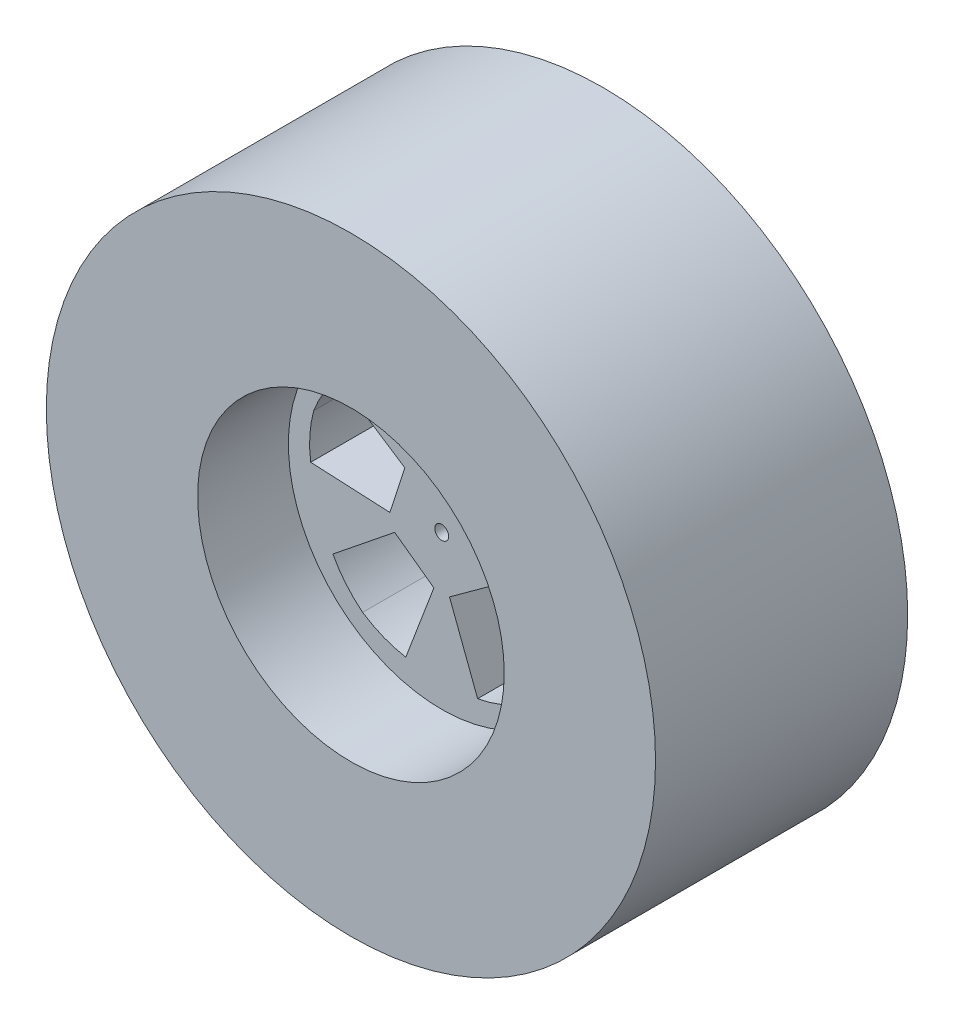
ISO-10303-21;
HEADER;
FILE_DESCRIPTION(('STEP AP214'),'2;1');
FILE_NAME('part.step','',(''),(''),'','','');
FILE_SCHEMA(('AUTOMOTIVE_DESIGN { 1 0 10303 214 1 1 1 1 }'));
ENDSEC;
DATA;
#1=APPLICATION_CONTEXT('core data for automotive mechanical design processes');
#2=APPLICATION_PROTOCOL_DEFINITION('international standard','automotive_design',2000,#1);
#3=PRODUCT_CONTEXT('',#1,'mechanical');
#4=PRODUCT('Part','Part','',(#3));
#5=PRODUCT_RELATED_PRODUCT_CATEGORY('part','',(#4));
#6=PRODUCT_DEFINITION_FORMATION('','',#4);
#7=PRODUCT_DEFINITION_CONTEXT('part definition',#1,'design');
#8=PRODUCT_DEFINITION('design','',#6,#7);
#9=PRODUCT_DEFINITION_SHAPE('','',#8);
#10=(LENGTH_UNIT() NAMED_UNIT(*) SI_UNIT(.MILLI.,.METRE.));
#11=(NAMED_UNIT(*) PLANE_ANGLE_UNIT() SI_UNIT($,.RADIAN.));
#12=(NAMED_UNIT(*) SI_UNIT($,.STERADIAN.) SOLID_ANGLE_UNIT());
#13=UNCERTAINTY_MEASURE_WITH_UNIT(LENGTH_MEASURE(1.E-05),#10,'distance_accuracy_value','');
#14=(GEOMETRIC_REPRESENTATION_CONTEXT(3) GLOBAL_UNCERTAINTY_ASSIGNED_CONTEXT((#13)) GLOBAL_UNIT_ASSIGNED_CONTEXT((#10,
#11,#12)) REPRESENTATION_CONTEXT('',''));
#15=CARTESIAN_POINT('',(0.,0.,0.));
#16=DIRECTION('',(0.,0.,1.));
#17=DIRECTION('',(1.,0.,0.));
#18=AXIS2_PLACEMENT_3D('',#15,#16,#17);
#19=CARTESIAN_POINT('',(0.,0.,-250.));
#20=DIRECTION('',(0.,0.,1.));
#21=DIRECTION('',(1.,0.,0.));
#22=AXIS2_PLACEMENT_3D('',#19,#20,#21);
#23=CYLINDRICAL_SURFACE('',#22,303.999999999998);
#24=CARTESIAN_POINT('',(0.,0.,-250.));
#25=DIRECTION('',(0.,0.,1.));
#26=DIRECTION('',(1.,0.,0.));
#27=AXIS2_PLACEMENT_3D('',#24,#25,#26);
#28=CIRCLE('',#27,303.999999999998);
#29=CARTESIAN_POINT('',(303.999999999998,0.,-250.));
#30=VERTEX_POINT('',#29);
#31=EDGE_CURVE('E425',#30,#30,#28,.T.);
#32=ORIENTED_EDGE('',*,*,#31,.F.);
#33=EDGE_LOOP('',(#32));
#34=FACE_BOUND('',#33,.T.);
#35=CARTESIAN_POINT('',(0.,0.,-70.));
#36=DIRECTION('',(0.,0.,1.));
#37=DIRECTION('',(1.,0.,0.));
#38=AXIS2_PLACEMENT_3D('',#35,#36,#37);
#39=CIRCLE('',#38,303.999999999998);
#40=CARTESIAN_POINT('',(303.999999999998,0.,-70.));
#41=VERTEX_POINT('',#40);
#42=EDGE_CURVE('E11',#41,#41,#39,.F.);
#43=ORIENTED_EDGE('',*,*,#42,.F.);
#44=EDGE_LOOP('',(#43));
#45=FACE_BOUND('',#44,.T.);
#46=ADVANCED_FACE('F41',(#34,#45),#23,.F.);
#47=CARTESIAN_POINT('',(0.,0.,70.));
#48=DIRECTION('',(0.,0.,1.));
#49=DIRECTION('',(1.,0.,0.));
#50=AXIS2_PLACEMENT_3D('',#47,#48,#49);
#51=CIRCLE('',#50,303.999999999998);
#52=CARTESIAN_POINT('',(303.999999999998,0.,70.));
#53=VERTEX_POINT('',#52);
#54=EDGE_CURVE('E377',#53,#53,#51,.T.);
#55=ORIENTED_EDGE('',*,*,#54,.F.);
#56=EDGE_LOOP('',(#55));
#57=FACE_BOUND('',#56,.T.);
#58=CARTESIAN_POINT('',(0.,0.,250.));
#59=DIRECTION('',(0.,0.,1.));
#60=DIRECTION('',(1.,0.,0.));
#61=AXIS2_PLACEMENT_3D('',#58,#59,#60);
#62=CIRCLE('',#61,303.999999999998);
#63=CARTESIAN_POINT('',(303.999999999998,0.,250.));
#64=VERTEX_POINT('',#63);
#65=EDGE_CURVE('E464',#64,#64,#62,.T.);
#66=ORIENTED_EDGE('',*,*,#65,.T.);
#67=EDGE_LOOP('',(#66));
#68=FACE_BOUND('',#67,.T.);
#69=ADVANCED_FACE('F43',(#57,#68),#23,.F.);
#70=CARTESIAN_POINT('',(0.,0.,-250.));
#71=DIRECTION('',(0.,0.,1.));
#72=DIRECTION('',(1.,0.,0.));
#73=AXIS2_PLACEMENT_3D('',#70,#71,#72);
#74=CYLINDRICAL_SURFACE('',#73,604.);
#75=CARTESIAN_POINT('',(0.,0.,-250.));
#76=DIRECTION('',(0.,0.,1.));
#77=DIRECTION('',(1.,0.,0.));
#78=AXIS2_PLACEMENT_3D('',#75,#76,#77);
#79=CIRCLE('',#78,604.);
#80=CARTESIAN_POINT('',(604.,0.,-250.));
#81=VERTEX_POINT('',#80);
#82=EDGE_CURVE('E51',#81,#81,#79,.T.);
#83=ORIENTED_EDGE('',*,*,#82,.T.);
#84=EDGE_LOOP('',(#83));
#85=FACE_BOUND('',#84,.T.);
#86=CARTESIAN_POINT('',(0.,0.,250.));
#87=DIRECTION('',(0.,0.,1.));
#88=DIRECTION('',(1.,0.,0.));
#89=AXIS2_PLACEMENT_3D('',#86,#87,#88);
#90=CIRCLE('',#89,604.);
#91=CARTESIAN_POINT('',(604.,0.,250.));
#92=VERTEX_POINT('',#91);
#93=EDGE_CURVE('E535',#92,#92,#90,.T.);
#94=ORIENTED_EDGE('',*,*,#93,.F.);
#95=EDGE_LOOP('',(#94));
#96=FACE_BOUND('',#95,.T.);
#97=ADVANCED_FACE('F408',(#85,#96),#74,.T.);
#98=CARTESIAN_POINT('',(0.,0.,-250.));
#99=DIRECTION('',(0.,0.,1.));
#100=DIRECTION('',(1.,0.,0.));
#101=AXIS2_PLACEMENT_3D('',#98,#99,#100);
#102=PLANE('',#101);
#103=ORIENTED_EDGE('',*,*,#31,.T.);
#104=EDGE_LOOP('',(#103));
#105=FACE_BOUND('',#104,.T.);
#106=ORIENTED_EDGE('',*,*,#82,.F.);
#107=EDGE_LOOP('',(#106));
#108=FACE_BOUND('',#107,.T.);
#109=ADVANCED_FACE('F405',(#105,#108),#102,.F.);
#110=CARTESIAN_POINT('',(0.,0.,250.));
#111=DIRECTION('',(0.,0.,1.));
#112=DIRECTION('',(1.,0.,0.));
#113=AXIS2_PLACEMENT_3D('',#110,#111,#112);
#114=PLANE('',#113);
#115=ORIENTED_EDGE('',*,*,#65,.F.);
#116=EDGE_LOOP('',(#115));
#117=FACE_BOUND('',#116,.T.);
#118=ORIENTED_EDGE('',*,*,#93,.T.);
#119=EDGE_LOOP('',(#118));
#120=FACE_BOUND('',#119,.T.);
#121=ADVANCED_FACE('F401',(#117,#120),#114,.T.);
#122=CARTESIAN_POINT('',(89.2857032912012,244.115512743488,-70.));
#123=CARTESIAN_POINT('',(47.2088763102181,264.62016009718,-70.));
#124=CARTESIAN_POINT('',(0.,266.705841083731,-70.));
#125=B_SPLINE_CURVE_WITH_KNOTS('',2,(#122,#123,#124),.UNSPECIFIED.,.F.,.F.,(3,3),(0.,1.),.UNSPECIFIED.);
#126=DIRECTION('',(0.,0.,1.));
#127=VECTOR('',#126,1.);
#128=SURFACE_OF_LINEAR_EXTRUSION('',#125,#127);
#129=DIRECTION('',(0.,0.,1.));
#130=VECTOR('',#129,1.);
#131=CARTESIAN_POINT('',(89.2857032912012,244.115512743488,-70.));
#132=LINE('',#131,#130);
#133=CARTESIAN_POINT('',(89.2857032912012,244.115512743488,-70.));
#134=VERTEX_POINT('',#133);
#135=CARTESIAN_POINT('',(89.2857032912012,244.115512743488,70.));
#136=VERTEX_POINT('',#135);
#137=EDGE_CURVE('E473',#134,#136,#132,.T.);
#138=ORIENTED_EDGE('',*,*,#137,.T.);
#139=CARTESIAN_POINT('',(89.2857032912012,244.115512743488,70.));
#140=CARTESIAN_POINT('',(47.2088763102181,264.62016009718,70.));
#141=CARTESIAN_POINT('',(0.,266.705841083731,70.));
#142=B_SPLINE_CURVE_WITH_KNOTS('',2,(#139,#140,#141),.UNSPECIFIED.,.F.,.F.,(3,3),(0.,1.),.UNSPECIFIED.);
#143=CARTESIAN_POINT('',(0.,266.705841083731,70.));
#144=VERTEX_POINT('',#143);
#145=EDGE_CURVE('E347',#136,#144,#142,.T.);
#146=ORIENTED_EDGE('',*,*,#145,.T.);
#147=DIRECTION('',(0.,0.,1.));
#148=VECTOR('',#147,1.);
#149=CARTESIAN_POINT('',(0.,266.705841083731,-70.));
#150=LINE('',#149,#148);
#151=CARTESIAN_POINT('',(0.,266.705841083731,-70.));
#152=VERTEX_POINT('',#151);
#153=EDGE_CURVE('E458',#152,#144,#150,.T.);
#154=ORIENTED_EDGE('',*,*,#153,.F.);
#155=EDGE_CURVE('E58',#134,#152,#125,.T.);
#156=ORIENTED_EDGE('',*,*,#155,.F.);
#157=EDGE_LOOP('',(#138,#146,#154,#156));
#158=FACE_BOUND('',#157,.T.);
#159=ADVANCED_FACE('F404',(#158),#128,.F.);
#160=CARTESIAN_POINT('',(-89.2857032912011,244.115512743488,-70.));
#161=CARTESIAN_POINT('',(-47.208876310218,264.62016009718,-70.));
#162=CARTESIAN_POINT('',(0.,266.705841083731,-70.));
#163=B_SPLINE_CURVE_WITH_KNOTS('',2,(#160,#161,#162),.UNSPECIFIED.,.F.,.F.,(3,3),(0.,1.),.UNSPECIFIED.);
#164=DIRECTION('',(0.,0.,1.));
#165=VECTOR('',#164,1.);
#166=SURFACE_OF_LINEAR_EXTRUSION('',#163,#165);
#167=ORIENTED_EDGE('',*,*,#153,.T.);
#168=CARTESIAN_POINT('',(-89.2857032912011,244.115512743488,70.));
#169=CARTESIAN_POINT('',(-47.208876310218,264.62016009718,70.));
#170=CARTESIAN_POINT('',(0.,266.705841083731,70.));
#171=B_SPLINE_CURVE_WITH_KNOTS('',2,(#168,#169,#170),.UNSPECIFIED.,.F.,.F.,(3,3),(0.,1.),.UNSPECIFIED.);
#172=CARTESIAN_POINT('',(-89.2857032912011,244.115512743488,70.));
#173=VERTEX_POINT('',#172);
#174=EDGE_CURVE('E371',#173,#144,#171,.T.);
#175=ORIENTED_EDGE('',*,*,#174,.F.);
#176=DIRECTION('',(0.,0.,1.));
#177=VECTOR('',#176,1.);
#178=CARTESIAN_POINT('',(-89.2857032912011,244.115512743488,-70.));
#179=LINE('',#178,#177);
#180=CARTESIAN_POINT('',(-89.2857032912011,244.115512743488,-70.));
#181=VERTEX_POINT('',#180);
#182=EDGE_CURVE('E66',#181,#173,#179,.T.);
#183=ORIENTED_EDGE('',*,*,#182,.F.);
#184=EDGE_CURVE('E224',#181,#152,#163,.T.);
#185=ORIENTED_EDGE('',*,*,#184,.T.);
#186=EDGE_LOOP('',(#167,#175,#183,#185));
#187=FACE_BOUND('',#186,.T.);
#188=ADVANCED_FACE('F444',(#187),#166,.T.);
#189=CARTESIAN_POINT('',(-21.337118769043,-5.80123982579253,-70.));
#190=DIRECTION('',(0.964969873653186,0.262360711505658,0.));
#191=DIRECTION('',(-0.262360711505658,0.964969873653186,0.));
#192=AXIS2_PLACEMENT_3D('',#189,#190,#191);
#193=PLANE('',#192);
#194=ORIENTED_EDGE('',*,*,#182,.T.);
#195=DIRECTION('',(-0.262360711505658,0.964969873653186,0.));
#196=VECTOR('',#195,1.);
#197=CARTESIAN_POINT('',(-21.337118769043,-5.80123982579253,70.));
#198=LINE('',#197,#196);
#199=CARTESIAN_POINT('',(-48.0589290693998,92.4823094195891,70.));
#200=VERTEX_POINT('',#199);
#201=EDGE_CURVE('E367',#200,#173,#198,.T.);
#202=ORIENTED_EDGE('',*,*,#201,.F.);
#203=DIRECTION('',(0.,0.,1.));
#204=VECTOR('',#203,1.);
#205=CARTESIAN_POINT('',(-48.0589290693998,92.4823094195891,-70.));
#206=LINE('',#205,#204);
#207=CARTESIAN_POINT('',(-48.0589290693998,92.4823094195891,-70.));
#208=VERTEX_POINT('',#207);
#209=EDGE_CURVE('E467',#208,#200,#206,.T.);
#210=ORIENTED_EDGE('',*,*,#209,.F.);
#211=DIRECTION('',(-0.262360711505658,0.964969873653186,0.));
#212=VECTOR('',#211,1.);
#213=CARTESIAN_POINT('',(-21.337118769043,-5.80123982579253,-70.));
#214=LINE('',#213,#212);
#215=EDGE_CURVE('E456',#208,#181,#214,.T.);
#216=ORIENTED_EDGE('',*,*,#215,.T.);
#217=EDGE_LOOP('',(#194,#202,#210,#216));
#218=FACE_BOUND('',#217,.T.);
#219=ADVANCED_FACE('F448',(#218),#193,.T.);
#220=CARTESIAN_POINT('',(0.,92.4823094195891,-70.));
#221=DIRECTION('',(0.,1.,0.));
#222=DIRECTION('',(-1.,0.,0.));
#223=AXIS2_PLACEMENT_3D('',#220,#221,#222);
#224=PLANE('',#223);
#225=ORIENTED_EDGE('',*,*,#209,.T.);
#226=DIRECTION('',(-1.,0.,0.));
#227=VECTOR('',#226,1.);
#228=CARTESIAN_POINT('',(0.,92.4823094195891,70.));
#229=LINE('',#228,#227);
#230=CARTESIAN_POINT('',(48.0589290693999,92.4823094195891,70.));
#231=VERTEX_POINT('',#230);
#232=EDGE_CURVE('E363',#231,#200,#229,.T.);
#233=ORIENTED_EDGE('',*,*,#232,.F.);
#234=DIRECTION('',(0.,0.,1.));
#235=VECTOR('',#234,1.);
#236=CARTESIAN_POINT('',(48.0589290693999,92.4823094195891,-70.));
#237=LINE('',#236,#235);
#238=CARTESIAN_POINT('',(48.0589290693999,92.4823094195891,-70.));
#239=VERTEX_POINT('',#238);
#240=EDGE_CURVE('E470',#239,#231,#237,.T.);
#241=ORIENTED_EDGE('',*,*,#240,.F.);
#242=DIRECTION('',(-1.,0.,0.));
#243=VECTOR('',#242,1.);
#244=CARTESIAN_POINT('',(0.,92.4823094195891,-70.));
#245=LINE('',#244,#243);
#246=EDGE_CURVE('E546',#239,#208,#245,.T.);
#247=ORIENTED_EDGE('',*,*,#246,.T.);
#248=EDGE_LOOP('',(#225,#233,#241,#247));
#249=FACE_BOUND('',#248,.T.);
#250=ADVANCED_FACE('F739',(#249),#224,.T.);
#251=CARTESIAN_POINT('',(259.75844879513,-9.4799078987993,-70.));
#252=CARTESIAN_POINT('',(266.25707266869,36.8738170824439,-70.));
#253=CARTESIAN_POINT('',(253.652328096662,82.4166373939361,-70.));
#254=B_SPLINE_CURVE_WITH_KNOTS('',2,(#251,#252,#253),.UNSPECIFIED.,.F.,.F.,(3,3),(0.,1.),.UNSPECIFIED.);
#255=DIRECTION('',(0.,0.,1.));
#256=VECTOR('',#255,1.);
#257=SURFACE_OF_LINEAR_EXTRUSION('',#254,#256);
#258=DIRECTION('',(0.,0.,1.));
#259=VECTOR('',#258,1.);
#260=CARTESIAN_POINT('',(259.758448795127,-9.4799078988016,-70.));
#261=LINE('',#260,#259);
#262=CARTESIAN_POINT('',(259.758448795127,-9.4799078988016,-70.));
#263=VERTEX_POINT('',#262);
#264=CARTESIAN_POINT('',(259.758448795127,-9.4799078988016,70.));
#265=VERTEX_POINT('',#264);
#266=EDGE_CURVE('E488',#263,#265,#261,.T.);
#267=ORIENTED_EDGE('',*,*,#266,.T.);
#268=CARTESIAN_POINT('',(259.75844879513,-9.4799078987993,70.));
#269=CARTESIAN_POINT('',(266.25707266869,36.8738170824439,70.));
#270=CARTESIAN_POINT('',(253.652328096662,82.4166373939361,70.));
#271=B_SPLINE_CURVE_WITH_KNOTS('',2,(#268,#269,#270),.UNSPECIFIED.,.F.,.F.,(3,3),(0.,1.),.UNSPECIFIED.);
#272=CARTESIAN_POINT('',(253.652328096662,82.4166373939361,70.));
#273=VERTEX_POINT('',#272);
#274=EDGE_CURVE('E317',#265,#273,#271,.T.);
#275=ORIENTED_EDGE('',*,*,#274,.T.);
#276=DIRECTION('',(0.,0.,1.));
#277=VECTOR('',#276,1.);
#278=CARTESIAN_POINT('',(253.652328096662,82.4166373939361,-70.));
#279=LINE('',#278,#277);
#280=CARTESIAN_POINT('',(253.652328096662,82.4166373939361,-70.));
#281=VERTEX_POINT('',#280);
#282=EDGE_CURVE('E476',#281,#273,#279,.T.);
#283=ORIENTED_EDGE('',*,*,#282,.F.);
#284=EDGE_CURVE('E568',#263,#281,#254,.T.);
#285=ORIENTED_EDGE('',*,*,#284,.F.);
#286=EDGE_LOOP('',(#267,#275,#283,#285));
#287=FACE_BOUND('',#286,.T.);
#288=ADVANCED_FACE('F708',(#287),#257,.F.);
#289=CARTESIAN_POINT('',(204.576849451729,160.351591955386,-70.));
#290=CARTESIAN_POINT('',(237.080382538286,126.67043596605,-70.));
#291=CARTESIAN_POINT('',(253.652328096662,82.4166373939361,-70.));
#292=B_SPLINE_CURVE_WITH_KNOTS('',2,(#289,#290,#291),.UNSPECIFIED.,.F.,.F.,(3,3),(0.,1.),.UNSPECIFIED.);
#293=DIRECTION('',(0.,0.,1.));
#294=VECTOR('',#293,1.);
#295=SURFACE_OF_LINEAR_EXTRUSION('',#292,#294);
#296=ORIENTED_EDGE('',*,*,#282,.T.);
#297=CARTESIAN_POINT('',(204.576849451729,160.351591955386,70.));
#298=CARTESIAN_POINT('',(237.080382538286,126.67043596605,70.));
#299=CARTESIAN_POINT('',(253.652328096662,82.4166373939361,70.));
#300=B_SPLINE_CURVE_WITH_KNOTS('',2,(#297,#298,#299),.UNSPECIFIED.,.F.,.F.,(3,3),(0.,1.),.UNSPECIFIED.);
#301=CARTESIAN_POINT('',(204.576849451727,160.351591955384,70.));
#302=VERTEX_POINT('',#301);
#303=EDGE_CURVE('E341',#302,#273,#300,.T.);
#304=ORIENTED_EDGE('',*,*,#303,.F.);
#305=DIRECTION('',(0.,0.,1.));
#306=VECTOR('',#305,1.);
#307=CARTESIAN_POINT('',(204.576849451727,160.351591955384,-70.));
#308=LINE('',#307,#306);
#309=CARTESIAN_POINT('',(204.576849451727,160.351591955384,-70.));
#310=VERTEX_POINT('',#309);
#311=EDGE_CURVE('E479',#310,#302,#308,.T.);
#312=ORIENTED_EDGE('',*,*,#311,.F.);
#313=EDGE_CURVE('E553',#310,#281,#292,.T.);
#314=ORIENTED_EDGE('',*,*,#313,.T.);
#315=EDGE_LOOP('',(#296,#304,#312,#314));
#316=FACE_BOUND('',#315,.T.);
#317=ADVANCED_FACE('F712',(#316),#295,.T.);
#318=CARTESIAN_POINT('',(-12.1108392495418,18.5001241496474,-70.));
#319=DIRECTION('',(0.547711954315966,-0.836666967854824,0.));
#320=DIRECTION('',(0.836666967854824,0.547711954315966,0.));
#321=AXIS2_PLACEMENT_3D('',#318,#319,#320);
#322=PLANE('',#321);
#323=ORIENTED_EDGE('',*,*,#311,.T.);
#324=DIRECTION('',(0.836666967854824,0.547711954315966,0.));
#325=VECTOR('',#324,1.);
#326=CARTESIAN_POINT('',(-12.1108392495418,18.5001241496474,70.));
#327=LINE('',#326,#325);
#328=CARTESIAN_POINT('',(73.1048772016204,74.2853629473144,70.));
#329=VERTEX_POINT('',#328);
#330=EDGE_CURVE('E337',#329,#302,#327,.T.);
#331=ORIENTED_EDGE('',*,*,#330,.F.);
#332=DIRECTION('',(0.,0.,1.));
#333=VECTOR('',#332,1.);
#334=CARTESIAN_POINT('',(73.1048772016204,74.2853629473144,-70.));
#335=LINE('',#334,#333);
#336=CARTESIAN_POINT('',(73.1048772016204,74.2853629473144,-70.));
#337=VERTEX_POINT('',#336);
#338=EDGE_CURVE('E482',#337,#329,#335,.T.);
#339=ORIENTED_EDGE('',*,*,#338,.F.);
#340=DIRECTION('',(0.836666967854824,0.547711954315966,0.));
#341=VECTOR('',#340,1.);
#342=CARTESIAN_POINT('',(-12.1108392495418,18.5001241496474,-70.));
#343=LINE('',#342,#341);
#344=EDGE_CURVE('E557',#337,#310,#343,.T.);
#345=ORIENTED_EDGE('',*,*,#344,.T.);
#346=EDGE_LOOP('',(#323,#331,#339,#345));
#347=FACE_BOUND('',#346,.T.);
#348=ADVANCED_FACE('F715',(#347),#322,.T.);
#349=CARTESIAN_POINT('',(87.955903015525,28.5786052896951,-70.));
#350=DIRECTION('',(0.951056516295155,0.309016994374945,0.));
#351=DIRECTION('',(-0.309016994374945,0.951056516295155,0.));
#352=AXIS2_PLACEMENT_3D('',#349,#350,#351);
#353=PLANE('',#352);
#354=ORIENTED_EDGE('',*,*,#338,.T.);
#355=DIRECTION('',(-0.309016994374945,0.951056516295154,0.));
#356=VECTOR('',#355,1.);
#357=CARTESIAN_POINT('',(87.955903015525,28.5786052896951,70.));
#358=LINE('',#357,#356);
#359=CARTESIAN_POINT('',(102.80692882943,-17.1281523679243,70.));
#360=VERTEX_POINT('',#359);
#361=EDGE_CURVE('E333',#360,#329,#358,.T.);
#362=ORIENTED_EDGE('',*,*,#361,.F.);
#363=DIRECTION('',(0.,0.,1.));
#364=VECTOR('',#363,1.);
#365=CARTESIAN_POINT('',(102.80692882943,-17.1281523679243,-70.));
#366=LINE('',#365,#364);
#367=CARTESIAN_POINT('',(102.80692882943,-17.1281523679243,-70.));
#368=VERTEX_POINT('',#367);
#369=EDGE_CURVE('E485',#368,#360,#366,.T.);
#370=ORIENTED_EDGE('',*,*,#369,.F.);
#371=DIRECTION('',(-0.309016994374945,0.951056516295154,0.));
#372=VECTOR('',#371,1.);
#373=CARTESIAN_POINT('',(87.955903015525,28.5786052896951,-70.));
#374=LINE('',#373,#372);
#375=EDGE_CURVE('E561',#368,#337,#374,.T.);
#376=ORIENTED_EDGE('',*,*,#375,.T.);
#377=EDGE_LOOP('',(#354,#362,#370,#376));
#378=FACE_BOUND('',#377,.T.);
#379=ADVANCED_FACE('F717',(#378),#353,.T.);
#380=CARTESIAN_POINT('',(71.2538469291419,-249.974418035166,-70.));
#381=CARTESIAN_POINT('',(117.347044344086,-241.830887845281,-70.));
#382=CARTESIAN_POINT('',(156.765760089276,-215.769557935803,-70.));
#383=B_SPLINE_CURVE_WITH_KNOTS('',2,(#380,#381,#382),.UNSPECIFIED.,.F.,.F.,(3,3),(0.,1.),.UNSPECIFIED.);
#384=DIRECTION('',(0.,0.,1.));
#385=VECTOR('',#384,1.);
#386=SURFACE_OF_LINEAR_EXTRUSION('',#383,#385);
#387=DIRECTION('',(0.,0.,1.));
#388=VECTOR('',#387,1.);
#389=CARTESIAN_POINT('',(71.253846929135,-249.974418035165,-70.));
#390=LINE('',#389,#388);
#391=CARTESIAN_POINT('',(71.253846929135,-249.974418035165,-70.));
#392=VERTEX_POINT('',#391);
#393=CARTESIAN_POINT('',(71.253846929135,-249.974418035165,70.));
#394=VERTEX_POINT('',#393);
#395=EDGE_CURVE('E503',#392,#394,#390,.T.);
#396=ORIENTED_EDGE('',*,*,#395,.T.);
#397=CARTESIAN_POINT('',(71.2538469291419,-249.974418035166,70.));
#398=CARTESIAN_POINT('',(117.347044344086,-241.830887845281,70.));
#399=CARTESIAN_POINT('',(156.765760089276,-215.769557935803,70.));
#400=B_SPLINE_CURVE_WITH_KNOTS('',2,(#397,#398,#399),.UNSPECIFIED.,.F.,.F.,(3,3),(0.,1.),.UNSPECIFIED.);
#401=CARTESIAN_POINT('',(156.765760089276,-215.769557935803,70.));
#402=VERTEX_POINT('',#401);
#403=EDGE_CURVE('E287',#394,#402,#400,.T.);
#404=ORIENTED_EDGE('',*,*,#403,.T.);
#405=DIRECTION('',(0.,0.,1.));
#406=VECTOR('',#405,1.);
#407=CARTESIAN_POINT('',(156.765760089276,-215.769557935803,-70.));
#408=LINE('',#407,#406);
#409=CARTESIAN_POINT('',(156.765760089276,-215.769557935803,-70.));
#410=VERTEX_POINT('',#409);
#411=EDGE_CURVE('E491',#410,#402,#408,.T.);
#412=ORIENTED_EDGE('',*,*,#411,.F.);
#413=EDGE_CURVE('E586',#392,#410,#383,.T.);
#414=ORIENTED_EDGE('',*,*,#413,.F.);
#415=EDGE_LOOP('',(#396,#404,#412,#414));
#416=FACE_BOUND('',#415,.T.);
#417=ADVANCED_FACE('F666',(#416),#386,.F.);
#418=CARTESIAN_POINT('',(215.721149563744,-145.012778764907,-70.));
#419=CARTESIAN_POINT('',(193.732610784704,-186.33352530039,-70.));
#420=CARTESIAN_POINT('',(156.765760089276,-215.769557935803,-70.));
#421=B_SPLINE_CURVE_WITH_KNOTS('',2,(#418,#419,#420),.UNSPECIFIED.,.F.,.F.,(3,3),(0.,1.),.UNSPECIFIED.);
#422=DIRECTION('',(0.,0.,1.));
#423=VECTOR('',#422,1.);
#424=SURFACE_OF_LINEAR_EXTRUSION('',#421,#423);
#425=ORIENTED_EDGE('',*,*,#411,.T.);
#426=CARTESIAN_POINT('',(215.721149563744,-145.012778764907,70.));
#427=CARTESIAN_POINT('',(193.732610784704,-186.33352530039,70.));
#428=CARTESIAN_POINT('',(156.765760089276,-215.769557935803,70.));
#429=B_SPLINE_CURVE_WITH_KNOTS('',2,(#426,#427,#428),.UNSPECIFIED.,.F.,.F.,(3,3),(0.,1.),.UNSPECIFIED.);
#430=CARTESIAN_POINT('',(215.721149563737,-145.012778764907,70.));
#431=VERTEX_POINT('',#430);
#432=EDGE_CURVE('E311',#431,#402,#429,.T.);
#433=ORIENTED_EDGE('',*,*,#432,.F.);
#434=DIRECTION('',(0.,0.,1.));
#435=VECTOR('',#434,1.);
#436=CARTESIAN_POINT('',(215.721149563737,-145.012778764907,-70.));
#437=LINE('',#436,#435);
#438=CARTESIAN_POINT('',(215.721149563737,-145.012778764907,-70.));
#439=VERTEX_POINT('',#438);
#440=EDGE_CURVE('E494',#439,#431,#437,.T.);
#441=ORIENTED_EDGE('',*,*,#440,.F.);
#442=EDGE_CURVE('E571',#439,#410,#421,.T.);
#443=ORIENTED_EDGE('',*,*,#442,.T.);
#444=EDGE_LOOP('',(#425,#433,#441,#443));
#445=FACE_BOUND('',#444,.T.);
#446=ADVANCED_FACE('F776',(#445),#424,.T.);
#447=CARTESIAN_POINT('',(13.8522084805399,17.2349453463673,-70.));
#448=DIRECTION('',(-0.626465269841292,-0.77944933490425,0.));
#449=DIRECTION('',(0.77944933490425,-0.626465269841292,0.));
#450=AXIS2_PLACEMENT_3D('',#447,#448,#449);
#451=PLANE('',#450);
#452=ORIENTED_EDGE('',*,*,#440,.T.);
#453=DIRECTION('',(0.77944933490425,-0.626465269841292,0.));
#454=VECTOR('',#453,1.);
#455=CARTESIAN_POINT('',(13.8522084805399,17.2349453463673,70.));
#456=LINE('',#455,#454);
#457=CARTESIAN_POINT('',(93.2402279233881,-46.5714302515272,70.));
#458=VERTEX_POINT('',#457);
#459=EDGE_CURVE('E307',#458,#431,#456,.T.);
#460=ORIENTED_EDGE('',*,*,#459,.F.);
#461=DIRECTION('',(0.,0.,1.));
#462=VECTOR('',#461,1.);
#463=CARTESIAN_POINT('',(93.2402279233881,-46.5714302515272,-70.));
#464=LINE('',#463,#462);
#465=CARTESIAN_POINT('',(93.2402279233881,-46.5714302515272,-70.));
#466=VERTEX_POINT('',#465);
#467=EDGE_CURVE('E497',#466,#458,#464,.T.);
#468=ORIENTED_EDGE('',*,*,#467,.F.);
#469=DIRECTION('',(0.77944933490425,-0.626465269841292,0.));
#470=VECTOR('',#469,1.);
#471=CARTESIAN_POINT('',(13.8522084805399,17.2349453463673,-70.));
#472=LINE('',#471,#470);
#473=EDGE_CURVE('E575',#466,#439,#472,.T.);
#474=ORIENTED_EDGE('',*,*,#473,.T.);
#475=EDGE_LOOP('',(#452,#460,#468,#474));
#476=FACE_BOUND('',#475,.T.);
#477=ADVANCED_FACE('F779',(#476),#451,.T.);
#478=CARTESIAN_POINT('',(54.3597375747833,-74.8197599994902,-70.));
#479=DIRECTION('',(0.587785252292469,-0.809016994374951,0.));
#480=DIRECTION('',(0.809016994374951,0.587785252292469,0.));
#481=AXIS2_PLACEMENT_3D('',#478,#479,#480);
#482=PLANE('',#481);
#483=ORIENTED_EDGE('',*,*,#467,.T.);
#484=DIRECTION('',(0.809016994374951,0.587785252292469,0.));
#485=VECTOR('',#484,1.);
#486=CARTESIAN_POINT('',(54.3597375747833,-74.8197599994902,70.));
#487=LINE('',#486,#485);
#488=CARTESIAN_POINT('',(15.4792472261785,-103.068089747453,70.));
#489=VERTEX_POINT('',#488);
#490=EDGE_CURVE('E303',#489,#458,#487,.T.);
#491=ORIENTED_EDGE('',*,*,#490,.F.);
#492=DIRECTION('',(0.,0.,1.));
#493=VECTOR('',#492,1.);
#494=CARTESIAN_POINT('',(15.4792472261785,-103.068089747453,-70.));
#495=LINE('',#494,#493);
#496=CARTESIAN_POINT('',(15.4792472261785,-103.068089747453,-70.));
#497=VERTEX_POINT('',#496);
#498=EDGE_CURVE('E500',#497,#489,#495,.T.);
#499=ORIENTED_EDGE('',*,*,#498,.F.);
#500=DIRECTION('',(0.809016994374951,0.587785252292469,0.));
#501=VECTOR('',#500,1.);
#502=CARTESIAN_POINT('',(54.3597375747833,-74.8197599994902,-70.));
#503=LINE('',#502,#501);
#504=EDGE_CURVE('E579',#497,#466,#503,.T.);
#505=ORIENTED_EDGE('',*,*,#504,.T.);
#506=EDGE_LOOP('',(#483,#491,#499,#505));
#507=FACE_BOUND('',#506,.T.);
#508=ADVANCED_FACE('F783',(#507),#482,.T.);
#509=CARTESIAN_POINT('',(-215.721149563734,-145.01277876491,-70.));
#510=CARTESIAN_POINT('',(-193.732610784707,-186.333525300394,-70.));
#511=CARTESIAN_POINT('',(-156.765760089279,-215.769557935801,-70.));
#512=B_SPLINE_CURVE_WITH_KNOTS('',2,(#509,#510,#511),.UNSPECIFIED.,.F.,.F.,(3,3),(0.,1.),.UNSPECIFIED.);
#513=DIRECTION('',(0.,0.,1.));
#514=VECTOR('',#513,1.);
#515=SURFACE_OF_LINEAR_EXTRUSION('',#512,#514);
#516=DIRECTION('',(0.,0.,1.));
#517=VECTOR('',#516,1.);
#518=CARTESIAN_POINT('',(-215.721149563739,-145.012778764904,-70.));
#519=LINE('',#518,#517);
#520=CARTESIAN_POINT('',(-215.721149563739,-145.012778764904,-70.));
#521=VERTEX_POINT('',#520);
#522=CARTESIAN_POINT('',(-215.721149563739,-145.012778764904,70.));
#523=VERTEX_POINT('',#522);
#524=EDGE_CURVE('E518',#521,#523,#519,.T.);
#525=ORIENTED_EDGE('',*,*,#524,.T.);
#526=CARTESIAN_POINT('',(-215.721149563734,-145.01277876491,70.));
#527=CARTESIAN_POINT('',(-193.732610784707,-186.333525300394,70.));
#528=CARTESIAN_POINT('',(-156.765760089279,-215.769557935801,70.));
#529=B_SPLINE_CURVE_WITH_KNOTS('',2,(#526,#527,#528),.UNSPECIFIED.,.F.,.F.,(3,3),(0.,1.),.UNSPECIFIED.);
#530=CARTESIAN_POINT('',(-156.765760089279,-215.769557935801,70.));
#531=VERTEX_POINT('',#530);
#532=EDGE_CURVE('E257',#523,#531,#529,.T.);
#533=ORIENTED_EDGE('',*,*,#532,.T.);
#534=DIRECTION('',(0.,0.,1.));
#535=VECTOR('',#534,1.);
#536=CARTESIAN_POINT('',(-156.765760089279,-215.769557935801,-70.));
#537=LINE('',#536,#535);
#538=CARTESIAN_POINT('',(-156.765760089279,-215.769557935801,-70.));
#539=VERTEX_POINT('',#538);
#540=EDGE_CURVE('E506',#539,#531,#537,.T.);
#541=ORIENTED_EDGE('',*,*,#540,.F.);
#542=EDGE_CURVE('E604',#521,#539,#512,.T.);
#543=ORIENTED_EDGE('',*,*,#542,.F.);
#544=EDGE_LOOP('',(#525,#533,#541,#543));
#545=FACE_BOUND('',#544,.T.);
#546=ADVANCED_FACE('F636',(#545),#515,.F.);
#547=CARTESIAN_POINT('',(-71.2538469291325,-249.974418035169,-70.));
#548=CARTESIAN_POINT('',(-117.347044344083,-241.830887845282,-70.));
#549=CARTESIAN_POINT('',(-156.765760089279,-215.769557935801,-70.));
#550=B_SPLINE_CURVE_WITH_KNOTS('',2,(#547,#548,#549),.UNSPECIFIED.,.F.,.F.,(3,3),(0.,1.),.UNSPECIFIED.);
#551=DIRECTION('',(0.,0.,1.));
#552=VECTOR('',#551,1.);
#553=SURFACE_OF_LINEAR_EXTRUSION('',#550,#552);
#554=ORIENTED_EDGE('',*,*,#540,.T.);
#555=CARTESIAN_POINT('',(-71.2538469291325,-249.974418035169,70.));
#556=CARTESIAN_POINT('',(-117.347044344083,-241.830887845282,70.));
#557=CARTESIAN_POINT('',(-156.765760089279,-215.769557935801,70.));
#558=B_SPLINE_CURVE_WITH_KNOTS('',2,(#555,#556,#557),.UNSPECIFIED.,.F.,.F.,(3,3),(0.,1.),.UNSPECIFIED.);
#559=CARTESIAN_POINT('',(-71.2538469291386,-249.974418035164,70.));
#560=VERTEX_POINT('',#559);
#561=EDGE_CURVE('E281',#560,#531,#558,.T.);
#562=ORIENTED_EDGE('',*,*,#561,.F.);
#563=DIRECTION('',(0.,0.,1.));
#564=VECTOR('',#563,1.);
#565=CARTESIAN_POINT('',(-71.2538469291386,-249.974418035164,-70.));
#566=LINE('',#565,#564);
#567=CARTESIAN_POINT('',(-71.2538469291386,-249.974418035164,-70.));
#568=VERTEX_POINT('',#567);
#569=EDGE_CURVE('E509',#568,#560,#566,.T.);
#570=ORIENTED_EDGE('',*,*,#569,.F.);
#571=EDGE_CURVE('E589',#568,#539,#550,.T.);
#572=ORIENTED_EDGE('',*,*,#571,.T.);
#573=EDGE_LOOP('',(#554,#562,#570,#572));
#574=FACE_BOUND('',#573,.T.);
#575=ADVANCED_FACE('F660',(#574),#553,.T.);
#576=CARTESIAN_POINT('',(20.671974909765,-7.84834213134567,-70.));
#577=DIRECTION('',(-0.934888783849256,0.354940786375502,0.));
#578=DIRECTION('',(-0.354940786375502,-0.934888783849256,0.));
#579=AXIS2_PLACEMENT_3D('',#576,#577,#578);
#580=PLANE('',#579);
#581=ORIENTED_EDGE('',*,*,#569,.T.);
#582=DIRECTION('',(-0.354940786375502,-0.934888783849256,0.));
#583=VECTOR('',#582,1.);
#584=CARTESIAN_POINT('',(20.671974909765,-7.84834213134567,70.));
#585=LINE('',#584,#583);
#586=CARTESIAN_POINT('',(-15.4792472261801,-103.068089747453,70.));
#587=VERTEX_POINT('',#586);
#588=EDGE_CURVE('E277',#587,#560,#585,.T.);
#589=ORIENTED_EDGE('',*,*,#588,.F.);
#590=DIRECTION('',(0.,0.,1.));
#591=VECTOR('',#590,1.);
#592=CARTESIAN_POINT('',(-15.4792472261801,-103.068089747453,-70.));
#593=LINE('',#592,#591);
#594=CARTESIAN_POINT('',(-15.4792472261801,-103.068089747453,-70.));
#595=VERTEX_POINT('',#594);
#596=EDGE_CURVE('E512',#595,#587,#593,.T.);
#597=ORIENTED_EDGE('',*,*,#596,.F.);
#598=DIRECTION('',(-0.354940786375502,-0.934888783849256,0.));
#599=VECTOR('',#598,1.);
#600=CARTESIAN_POINT('',(20.671974909765,-7.84834213134567,-70.));
#601=LINE('',#600,#599);
#602=EDGE_CURVE('E593',#595,#568,#601,.T.);
#603=ORIENTED_EDGE('',*,*,#602,.T.);
#604=EDGE_LOOP('',(#581,#589,#597,#603));
#605=FACE_BOUND('',#604,.T.);
#606=ADVANCED_FACE('F664',(#605),#580,.T.);
#607=CARTESIAN_POINT('',(-54.3597375747844,-74.8197599994894,-70.));
#608=DIRECTION('',(-0.58778525229248,-0.809016994374942,0.));
#609=DIRECTION('',(0.809016994374942,-0.58778525229248,0.));
#610=AXIS2_PLACEMENT_3D('',#607,#608,#609);
#611=PLANE('',#610);
#612=ORIENTED_EDGE('',*,*,#596,.T.);
#613=DIRECTION('',(0.809016994374942,-0.58778525229248,0.));
#614=VECTOR('',#613,1.);
#615=CARTESIAN_POINT('',(-54.3597375747844,-74.8197599994894,70.));
#616=LINE('',#615,#614);
#617=CARTESIAN_POINT('',(-93.2402279233888,-46.5714302515258,70.));
#618=VERTEX_POINT('',#617);
#619=EDGE_CURVE('E273',#618,#587,#616,.T.);
#620=ORIENTED_EDGE('',*,*,#619,.F.);
#621=DIRECTION('',(0.,0.,1.));
#622=VECTOR('',#621,1.);
#623=CARTESIAN_POINT('',(-93.2402279233888,-46.5714302515258,-70.));
#624=LINE('',#623,#622);
#625=CARTESIAN_POINT('',(-93.2402279233888,-46.5714302515258,-70.));
#626=VERTEX_POINT('',#625);
#627=EDGE_CURVE('E515',#626,#618,#624,.T.);
#628=ORIENTED_EDGE('',*,*,#627,.F.);
#629=DIRECTION('',(0.809016994374942,-0.58778525229248,0.));
#630=VECTOR('',#629,1.);
#631=CARTESIAN_POINT('',(-54.3597375747844,-74.8197599994894,-70.));
#632=LINE('',#631,#630);
#633=EDGE_CURVE('E597',#626,#595,#632,.T.);
#634=ORIENTED_EDGE('',*,*,#633,.T.);
#635=EDGE_LOOP('',(#612,#620,#628,#634));
#636=FACE_BOUND('',#635,.T.);
#637=ADVANCED_FACE('F399',(#636),#611,.T.);
#638=CARTESIAN_POINT('',(-204.576849451726,160.351591955381,-70.));
#639=CARTESIAN_POINT('',(-237.080382538289,126.670435966054,-70.));
#640=CARTESIAN_POINT('',(-253.652328096661,82.4166373939397,-70.));
#641=B_SPLINE_CURVE_WITH_KNOTS('',2,(#638,#639,#640),.UNSPECIFIED.,.F.,.F.,(3,3),(0.,1.),.UNSPECIFIED.);
#642=DIRECTION('',(0.,0.,1.));
#643=VECTOR('',#642,1.);
#644=SURFACE_OF_LINEAR_EXTRUSION('',#641,#643);
#645=DIRECTION('',(0.,0.,1.));
#646=VECTOR('',#645,1.);
#647=CARTESIAN_POINT('',(-204.576849451724,160.351591955387,-70.));
#648=LINE('',#647,#646);
#649=CARTESIAN_POINT('',(-204.576849451724,160.351591955387,-70.));
#650=VERTEX_POINT('',#649);
#651=CARTESIAN_POINT('',(-204.576849451724,160.351591955387,70.));
#652=VERTEX_POINT('',#651);
#653=EDGE_CURVE('E213',#650,#652,#648,.T.);
#654=ORIENTED_EDGE('',*,*,#653,.T.);
#655=CARTESIAN_POINT('',(-204.576849451726,160.351591955381,70.));
#656=CARTESIAN_POINT('',(-237.080382538289,126.670435966054,70.));
#657=CARTESIAN_POINT('',(-253.652328096661,82.4166373939397,70.));
#658=B_SPLINE_CURVE_WITH_KNOTS('',2,(#655,#656,#657),.UNSPECIFIED.,.F.,.F.,(3,3),(0.,1.),.UNSPECIFIED.);
#659=CARTESIAN_POINT('',(-253.652328096661,82.4166373939397,70.));
#660=VERTEX_POINT('',#659);
#661=EDGE_CURVE('E217',#652,#660,#658,.T.);
#662=ORIENTED_EDGE('',*,*,#661,.T.);
#663=DIRECTION('',(0.,0.,1.));
#664=VECTOR('',#663,1.);
#665=CARTESIAN_POINT('',(-253.652328096661,82.4166373939397,-70.));
#666=LINE('',#665,#664);
#667=CARTESIAN_POINT('',(-253.652328096661,82.4166373939397,-70.));
#668=VERTEX_POINT('',#667);
#669=EDGE_CURVE('E521',#668,#660,#666,.T.);
#670=ORIENTED_EDGE('',*,*,#669,.F.);
#671=EDGE_CURVE('E218',#650,#668,#641,.T.);
#672=ORIENTED_EDGE('',*,*,#671,.F.);
#673=EDGE_LOOP('',(#654,#662,#670,#672));
#674=FACE_BOUND('',#673,.T.);
#675=ADVANCED_FACE('F215',(#674),#644,.F.);
#676=CARTESIAN_POINT('',(-259.758448795126,-9.47990789880425,-70.));
#677=CARTESIAN_POINT('',(-266.257072668693,36.8738170824432,-70.));
#678=CARTESIAN_POINT('',(-253.652328096661,82.4166373939397,-70.));
#679=B_SPLINE_CURVE_WITH_KNOTS('',2,(#676,#677,#678),.UNSPECIFIED.,.F.,.F.,(3,3),(0.,1.),.UNSPECIFIED.);
#680=DIRECTION('',(0.,0.,1.));
#681=VECTOR('',#680,1.);
#682=SURFACE_OF_LINEAR_EXTRUSION('',#679,#681);
#683=ORIENTED_EDGE('',*,*,#669,.T.);
#684=CARTESIAN_POINT('',(-259.758448795126,-9.47990789880425,70.));
#685=CARTESIAN_POINT('',(-266.257072668693,36.8738170824432,70.));
#686=CARTESIAN_POINT('',(-253.652328096661,82.4166373939397,70.));
#687=B_SPLINE_CURVE_WITH_KNOTS('',2,(#684,#685,#686),.UNSPECIFIED.,.F.,.F.,(3,3),(0.,1.),.UNSPECIFIED.);
#688=CARTESIAN_POINT('',(-259.758448795127,-9.47990789879782,70.));
#689=VERTEX_POINT('',#688);
#690=EDGE_CURVE('E235',#689,#660,#687,.T.);
#691=ORIENTED_EDGE('',*,*,#690,.F.);
#692=DIRECTION('',(0.,0.,1.));
#693=VECTOR('',#692,1.);
#694=CARTESIAN_POINT('',(-259.758448795127,-9.47990789879782,-70.));
#695=LINE('',#694,#693);
#696=CARTESIAN_POINT('',(-259.758448795127,-9.47990789879782,-70.));
#697=VERTEX_POINT('',#696);
#698=EDGE_CURVE('E524',#697,#689,#695,.T.);
#699=ORIENTED_EDGE('',*,*,#698,.F.);
#700=EDGE_CURVE('E607',#697,#668,#679,.T.);
#701=ORIENTED_EDGE('',*,*,#700,.T.);
#702=EDGE_LOOP('',(#683,#691,#699,#701));
#703=FACE_BOUND('',#702,.T.);
#704=ADVANCED_FACE('F398',(#703),#682,.T.);
#705=CARTESIAN_POINT('',(-1.07622537172025,-22.0854875388766,-70.));
#706=DIRECTION('',(0.0486722257214029,0.998814804877924,0.));
#707=DIRECTION('',(-0.998814804877924,0.0486722257214029,0.));
#708=AXIS2_PLACEMENT_3D('',#705,#706,#707);
#709=PLANE('',#708);
#710=ORIENTED_EDGE('',*,*,#698,.T.);
#711=DIRECTION('',(-0.998814804877924,0.0486722257214029,0.));
#712=VECTOR('',#711,1.);
#713=CARTESIAN_POINT('',(-1.07622537172025,-22.0854875388766,70.));
#714=LINE('',#713,#712);
#715=CARTESIAN_POINT('',(-102.80692882943,-17.1281523679228,70.));
#716=VERTEX_POINT('',#715);
#717=EDGE_CURVE('E245',#716,#689,#714,.T.);
#718=ORIENTED_EDGE('',*,*,#717,.F.);
#719=DIRECTION('',(0.,0.,1.));
#720=VECTOR('',#719,1.);
#721=CARTESIAN_POINT('',(-102.80692882943,-17.1281523679228,-70.));
#722=LINE('',#721,#720);
#723=CARTESIAN_POINT('',(-102.80692882943,-17.1281523679228,-70.));
#724=VERTEX_POINT('',#723);
#725=EDGE_CURVE('E527',#724,#716,#722,.T.);
#726=ORIENTED_EDGE('',*,*,#725,.F.);
#727=DIRECTION('',(-0.998814804877924,0.0486722257214029,0.));
#728=VECTOR('',#727,1.);
#729=CARTESIAN_POINT('',(-1.07622537172025,-22.0854875388766,-70.));
#730=LINE('',#729,#728);
#731=EDGE_CURVE('E611',#724,#697,#730,.T.);
#732=ORIENTED_EDGE('',*,*,#731,.T.);
#733=EDGE_LOOP('',(#710,#718,#726,#732));
#734=FACE_BOUND('',#733,.T.);
#735=ADVANCED_FACE('F627',(#734),#709,.T.);
#736=CARTESIAN_POINT('',(-87.9559030155246,28.5786052896963,-70.));
#737=DIRECTION('',(-0.95105651629515,0.309016994374958,0.));
#738=DIRECTION('',(-0.309016994374958,-0.95105651629515,0.));
#739=AXIS2_PLACEMENT_3D('',#736,#737,#738);
#740=PLANE('',#739);
#741=ORIENTED_EDGE('',*,*,#725,.T.);
#742=DIRECTION('',(-0.309016994374958,-0.95105651629515,0.));
#743=VECTOR('',#742,1.);
#744=CARTESIAN_POINT('',(-87.9559030155246,28.5786052896963,70.));
#745=LINE('',#744,#743);
#746=CARTESIAN_POINT('',(-73.1048772016194,74.2853629473155,70.));
#747=VERTEX_POINT('',#746);
#748=EDGE_CURVE('E242',#747,#716,#745,.T.);
#749=ORIENTED_EDGE('',*,*,#748,.F.);
#750=DIRECTION('',(0.,0.,1.));
#751=VECTOR('',#750,1.);
#752=CARTESIAN_POINT('',(-73.1048772016194,74.2853629473155,-70.));
#753=LINE('',#752,#751);
#754=CARTESIAN_POINT('',(-73.1048772016194,74.2853629473155,-70.));
#755=VERTEX_POINT('',#754);
#756=EDGE_CURVE('E223',#755,#747,#753,.T.);
#757=ORIENTED_EDGE('',*,*,#756,.F.);
#758=DIRECTION('',(-0.309016994374958,-0.95105651629515,0.));
#759=VECTOR('',#758,1.);
#760=CARTESIAN_POINT('',(-87.9559030155246,28.5786052896963,-70.));
#761=LINE('',#760,#759);
#762=EDGE_CURVE('E615',#755,#724,#761,.T.);
#763=ORIENTED_EDGE('',*,*,#762,.T.);
#764=EDGE_LOOP('',(#741,#749,#757,#763));
#765=FACE_BOUND('',#764,.T.);
#766=ADVANCED_FACE('F624',(#765),#740,.T.);
#767=CARTESIAN_POINT('',(21.3371187690431,-5.80123982579255,-70.));
#768=DIRECTION('',(0.964969873653186,-0.262360711505658,0.));
#769=DIRECTION('',(0.262360711505658,0.964969873653186,0.));
#770=AXIS2_PLACEMENT_3D('',#767,#768,#769);
#771=PLANE('',#770);
#772=ORIENTED_EDGE('',*,*,#240,.T.);
#773=DIRECTION('',(0.262360711505658,0.964969873653186,0.));
#774=VECTOR('',#773,1.);
#775=CARTESIAN_POINT('',(21.3371187690431,-5.80123982579255,70.));
#776=LINE('',#775,#774);
#777=EDGE_CURVE('E356',#231,#136,#776,.T.);
#778=ORIENTED_EDGE('',*,*,#777,.T.);
#779=ORIENTED_EDGE('',*,*,#137,.F.);
#780=DIRECTION('',(0.262360711505658,0.964969873653186,0.));
#781=VECTOR('',#780,1.);
#782=CARTESIAN_POINT('',(21.3371187690431,-5.80123982579255,-70.));
#783=LINE('',#782,#781);
#784=EDGE_CURVE('E549',#239,#134,#783,.T.);
#785=ORIENTED_EDGE('',*,*,#784,.F.);
#786=EDGE_LOOP('',(#772,#778,#779,#785));
#787=FACE_BOUND('',#786,.T.);
#788=ADVANCED_FACE('F734',(#787),#771,.F.);
#789=CARTESIAN_POINT('',(1.07622537171994,-22.0854875388767,-70.));
#790=DIRECTION('',(0.0486722257213888,-0.998814804877924,0.));
#791=DIRECTION('',(0.998814804877924,0.0486722257213888,0.));
#792=AXIS2_PLACEMENT_3D('',#789,#790,#791);
#793=PLANE('',#792);
#794=ORIENTED_EDGE('',*,*,#369,.T.);
#795=DIRECTION('',(0.998814804877924,0.0486722257213888,0.));
#796=VECTOR('',#795,1.);
#797=CARTESIAN_POINT('',(1.07622537171994,-22.0854875388767,70.));
#798=LINE('',#797,#796);
#799=EDGE_CURVE('E326',#360,#265,#798,.T.);
#800=ORIENTED_EDGE('',*,*,#799,.T.);
#801=ORIENTED_EDGE('',*,*,#266,.F.);
#802=DIRECTION('',(0.998814804877924,0.0486722257213888,0.));
#803=VECTOR('',#802,1.);
#804=CARTESIAN_POINT('',(1.07622537171994,-22.0854875388767,-70.));
#805=LINE('',#804,#803);
#806=EDGE_CURVE('E565',#368,#263,#805,.T.);
#807=ORIENTED_EDGE('',*,*,#806,.F.);
#808=EDGE_LOOP('',(#794,#800,#801,#807));
#809=FACE_BOUND('',#808,.T.);
#810=ADVANCED_FACE('F679',(#809),#793,.F.);
#811=CARTESIAN_POINT('',(-20.6719749097652,-7.84834213134541,-70.));
#812=DIRECTION('',(-0.934888783849261,-0.354940786375489,0.));
#813=DIRECTION('',(0.354940786375489,-0.934888783849261,0.));
#814=AXIS2_PLACEMENT_3D('',#811,#812,#813);
#815=PLANE('',#814);
#816=ORIENTED_EDGE('',*,*,#498,.T.);
#817=DIRECTION('',(0.354940786375489,-0.934888783849261,0.));
#818=VECTOR('',#817,1.);
#819=CARTESIAN_POINT('',(-20.6719749097652,-7.84834213134541,70.));
#820=LINE('',#819,#818);
#821=EDGE_CURVE('E296',#489,#394,#820,.T.);
#822=ORIENTED_EDGE('',*,*,#821,.T.);
#823=ORIENTED_EDGE('',*,*,#395,.F.);
#824=DIRECTION('',(0.354940786375489,-0.934888783849261,0.));
#825=VECTOR('',#824,1.);
#826=CARTESIAN_POINT('',(-20.6719749097652,-7.84834213134541,-70.));
#827=LINE('',#826,#825);
#828=EDGE_CURVE('E583',#497,#392,#827,.T.);
#829=ORIENTED_EDGE('',*,*,#828,.F.);
#830=EDGE_LOOP('',(#816,#822,#823,#829));
#831=FACE_BOUND('',#830,.T.);
#832=ADVANCED_FACE('F674',(#831),#815,.F.);
#833=CARTESIAN_POINT('',(-13.8522084805398,17.2349453463675,-70.));
#834=DIRECTION('',(-0.626465269841281,0.779449334904259,0.));
#835=DIRECTION('',(-0.779449334904259,-0.626465269841281,0.));
#836=AXIS2_PLACEMENT_3D('',#833,#834,#835);
#837=PLANE('',#836);
#838=ORIENTED_EDGE('',*,*,#627,.T.);
#839=DIRECTION('',(-0.779449334904259,-0.626465269841281,0.));
#840=VECTOR('',#839,1.);
#841=CARTESIAN_POINT('',(-13.8522084805398,17.2349453463675,70.));
#842=LINE('',#841,#840);
#843=EDGE_CURVE('E266',#618,#523,#842,.T.);
#844=ORIENTED_EDGE('',*,*,#843,.T.);
#845=ORIENTED_EDGE('',*,*,#524,.F.);
#846=DIRECTION('',(-0.779449334904259,-0.626465269841281,0.));
#847=VECTOR('',#846,1.);
#848=CARTESIAN_POINT('',(-13.8522084805398,17.2349453463675,-70.));
#849=LINE('',#848,#847);
#850=EDGE_CURVE('E601',#626,#521,#849,.T.);
#851=ORIENTED_EDGE('',*,*,#850,.F.);
#852=EDGE_LOOP('',(#838,#844,#845,#851));
#853=FACE_BOUND('',#852,.T.);
#854=ADVANCED_FACE('F439',(#853),#837,.F.);
#855=CARTESIAN_POINT('',(12.1108392495421,18.5001241496473,-70.));
#856=DIRECTION('',(0.547711954315978,0.836666967854816,0.));
#857=DIRECTION('',(-0.836666967854816,0.547711954315978,0.));
#858=AXIS2_PLACEMENT_3D('',#855,#856,#857);
#859=PLANE('',#858);
#860=ORIENTED_EDGE('',*,*,#756,.T.);
#861=DIRECTION('',(-0.836666967854816,0.547711954315978,0.));
#862=VECTOR('',#861,1.);
#863=CARTESIAN_POINT('',(12.1108392495421,18.5001241496473,70.));
#864=LINE('',#863,#862);
#865=EDGE_CURVE('E232',#747,#652,#864,.T.);
#866=ORIENTED_EDGE('',*,*,#865,.T.);
#867=ORIENTED_EDGE('',*,*,#653,.F.);
#868=DIRECTION('',(-0.836666967854816,0.547711954315978,0.));
#869=VECTOR('',#868,1.);
#870=CARTESIAN_POINT('',(12.1108392495421,18.5001241496473,-70.));
#871=LINE('',#870,#869);
#872=EDGE_CURVE('E389',#755,#650,#871,.T.);
#873=ORIENTED_EDGE('',*,*,#872,.F.);
#874=EDGE_LOOP('',(#860,#866,#867,#873));
#875=FACE_BOUND('',#874,.T.);
#876=ADVANCED_FACE('F239',(#875),#859,.F.);
#877=CARTESIAN_POINT('',(0.,0.,-70.));
#878=DIRECTION('',(0.,0.,1.));
#879=DIRECTION('',(1.,0.,0.));
#880=AXIS2_PLACEMENT_3D('',#877,#878,#879);
#881=PLANE('',#880);
#882=CARTESIAN_POINT('',(0.,0.,-70.));
#883=DIRECTION('',(0.,0.,1.));
#884=DIRECTION('',(1.,0.,0.));
#885=AXIS2_PLACEMENT_3D('',#882,#883,#884);
#886=CIRCLE('',#885,13.7990065521813);
#887=CARTESIAN_POINT('',(13.7990065521813,0.,-70.));
#888=VERTEX_POINT('',#887);
#889=EDGE_CURVE('E237',#888,#888,#886,.T.);
#890=ORIENTED_EDGE('',*,*,#889,.T.);
#891=EDGE_LOOP('',(#890));
#892=FACE_BOUND('',#891,.T.);
#893=ORIENTED_EDGE('',*,*,#671,.T.);
#894=ORIENTED_EDGE('',*,*,#700,.F.);
#895=ORIENTED_EDGE('',*,*,#731,.F.);
#896=ORIENTED_EDGE('',*,*,#762,.F.);
#897=ORIENTED_EDGE('',*,*,#872,.T.);
#898=EDGE_LOOP('',(#893,#894,#895,#896,#897));
#899=FACE_BOUND('',#898,.T.);
#900=ORIENTED_EDGE('',*,*,#542,.T.);
#901=ORIENTED_EDGE('',*,*,#571,.F.);
#902=ORIENTED_EDGE('',*,*,#602,.F.);
#903=ORIENTED_EDGE('',*,*,#633,.F.);
#904=ORIENTED_EDGE('',*,*,#850,.T.);
#905=EDGE_LOOP('',(#900,#901,#902,#903,#904));
#906=FACE_BOUND('',#905,.T.);
#907=ORIENTED_EDGE('',*,*,#413,.T.);
#908=ORIENTED_EDGE('',*,*,#442,.F.);
#909=ORIENTED_EDGE('',*,*,#473,.F.);
#910=ORIENTED_EDGE('',*,*,#504,.F.);
#911=ORIENTED_EDGE('',*,*,#828,.T.);
#912=EDGE_LOOP('',(#907,#908,#909,#910,#911));
#913=FACE_BOUND('',#912,.T.);
#914=ORIENTED_EDGE('',*,*,#284,.T.);
#915=ORIENTED_EDGE('',*,*,#313,.F.);
#916=ORIENTED_EDGE('',*,*,#344,.F.);
#917=ORIENTED_EDGE('',*,*,#375,.F.);
#918=ORIENTED_EDGE('',*,*,#806,.T.);
#919=EDGE_LOOP('',(#914,#915,#916,#917,#918));
#920=FACE_BOUND('',#919,.T.);
#921=ORIENTED_EDGE('',*,*,#155,.T.);
#922=ORIENTED_EDGE('',*,*,#184,.F.);
#923=ORIENTED_EDGE('',*,*,#215,.F.);
#924=ORIENTED_EDGE('',*,*,#246,.F.);
#925=ORIENTED_EDGE('',*,*,#784,.T.);
#926=EDGE_LOOP('',(#921,#922,#923,#924,#925));
#927=FACE_BOUND('',#926,.T.);
#928=ORIENTED_EDGE('',*,*,#42,.T.);
#929=EDGE_LOOP('',(#928));
#930=FACE_BOUND('',#929,.T.);
#931=ADVANCED_FACE('F428',(#892,#899,#906,#913,#920,#927,#930),#881,.F.);
#932=CARTESIAN_POINT('',(0.,0.,70.));
#933=DIRECTION('',(0.,0.,1.));
#934=DIRECTION('',(1.,0.,0.));
#935=AXIS2_PLACEMENT_3D('',#932,#933,#934);
#936=PLANE('',#935);
#937=CARTESIAN_POINT('',(0.,0.,70.));
#938=DIRECTION('',(0.,0.,1.));
#939=DIRECTION('',(1.,0.,0.));
#940=AXIS2_PLACEMENT_3D('',#937,#938,#939);
#941=CIRCLE('',#940,13.7990065521813);
#942=CARTESIAN_POINT('',(13.7990065521813,0.,70.));
#943=VERTEX_POINT('',#942);
#944=EDGE_CURVE('E45',#943,#943,#941,.T.);
#945=ORIENTED_EDGE('',*,*,#944,.F.);
#946=EDGE_LOOP('',(#945));
#947=FACE_BOUND('',#946,.T.);
#948=ORIENTED_EDGE('',*,*,#661,.F.);
#949=ORIENTED_EDGE('',*,*,#865,.F.);
#950=ORIENTED_EDGE('',*,*,#748,.T.);
#951=ORIENTED_EDGE('',*,*,#717,.T.);
#952=ORIENTED_EDGE('',*,*,#690,.T.);
#953=EDGE_LOOP('',(#948,#949,#950,#951,#952));
#954=FACE_BOUND('',#953,.T.);
#955=ORIENTED_EDGE('',*,*,#532,.F.);
#956=ORIENTED_EDGE('',*,*,#843,.F.);
#957=ORIENTED_EDGE('',*,*,#619,.T.);
#958=ORIENTED_EDGE('',*,*,#588,.T.);
#959=ORIENTED_EDGE('',*,*,#561,.T.);
#960=EDGE_LOOP('',(#955,#956,#957,#958,#959));
#961=FACE_BOUND('',#960,.T.);
#962=ORIENTED_EDGE('',*,*,#403,.F.);
#963=ORIENTED_EDGE('',*,*,#821,.F.);
#964=ORIENTED_EDGE('',*,*,#490,.T.);
#965=ORIENTED_EDGE('',*,*,#459,.T.);
#966=ORIENTED_EDGE('',*,*,#432,.T.);
#967=EDGE_LOOP('',(#962,#963,#964,#965,#966));
#968=FACE_BOUND('',#967,.T.);
#969=ORIENTED_EDGE('',*,*,#274,.F.);
#970=ORIENTED_EDGE('',*,*,#799,.F.);
#971=ORIENTED_EDGE('',*,*,#361,.T.);
#972=ORIENTED_EDGE('',*,*,#330,.T.);
#973=ORIENTED_EDGE('',*,*,#303,.T.);
#974=EDGE_LOOP('',(#969,#970,#971,#972,#973));
#975=FACE_BOUND('',#974,.T.);
#976=ORIENTED_EDGE('',*,*,#145,.F.);
#977=ORIENTED_EDGE('',*,*,#777,.F.);
#978=ORIENTED_EDGE('',*,*,#232,.T.);
#979=ORIENTED_EDGE('',*,*,#201,.T.);
#980=ORIENTED_EDGE('',*,*,#174,.T.);
#981=EDGE_LOOP('',(#976,#977,#978,#979,#980));
#982=FACE_BOUND('',#981,.T.);
#983=ORIENTED_EDGE('',*,*,#54,.T.);
#984=EDGE_LOOP('',(#983));
#985=FACE_BOUND('',#984,.T.);
#986=ADVANCED_FACE('F229',(#947,#954,#961,#968,#975,#982,#985),#936,.T.);
#987=CARTESIAN_POINT('',(0.,0.,-80.));
#988=DIRECTION('',(0.,0.,1.));
#989=DIRECTION('',(1.,0.,0.));
#990=AXIS2_PLACEMENT_3D('',#987,#988,#989);
#991=CYLINDRICAL_SURFACE('',#990,13.7990065521813);
#992=ORIENTED_EDGE('',*,*,#944,.T.);
#993=EDGE_LOOP('',(#992));
#994=FACE_BOUND('',#993,.T.);
#995=ORIENTED_EDGE('',*,*,#889,.F.);
#996=EDGE_LOOP('',(#995));
#997=FACE_BOUND('',#996,.T.);
#998=ADVANCED_FACE('F436',(#994,#997),#991,.F.);
#999=CLOSED_SHELL('',(#46,#69,#97,#109,#121,#159,#188,#219,#250,#288,#317,#348,#379,#417,#446,
#477,#508,#546,#575,#606,#637,#675,#704,#735,#766,#788,#810,#832,#854,#876,#931,#986,#998));
#1000=MANIFOLD_SOLID_BREP('B2',#999);
#1001=ADVANCED_BREP_SHAPE_REPRESENTATION('',(#18,#1000),#14);
#1002=SHAPE_DEFINITION_REPRESENTATION(#9,#1001);
ENDSEC;
END-ISO-10303-21;
